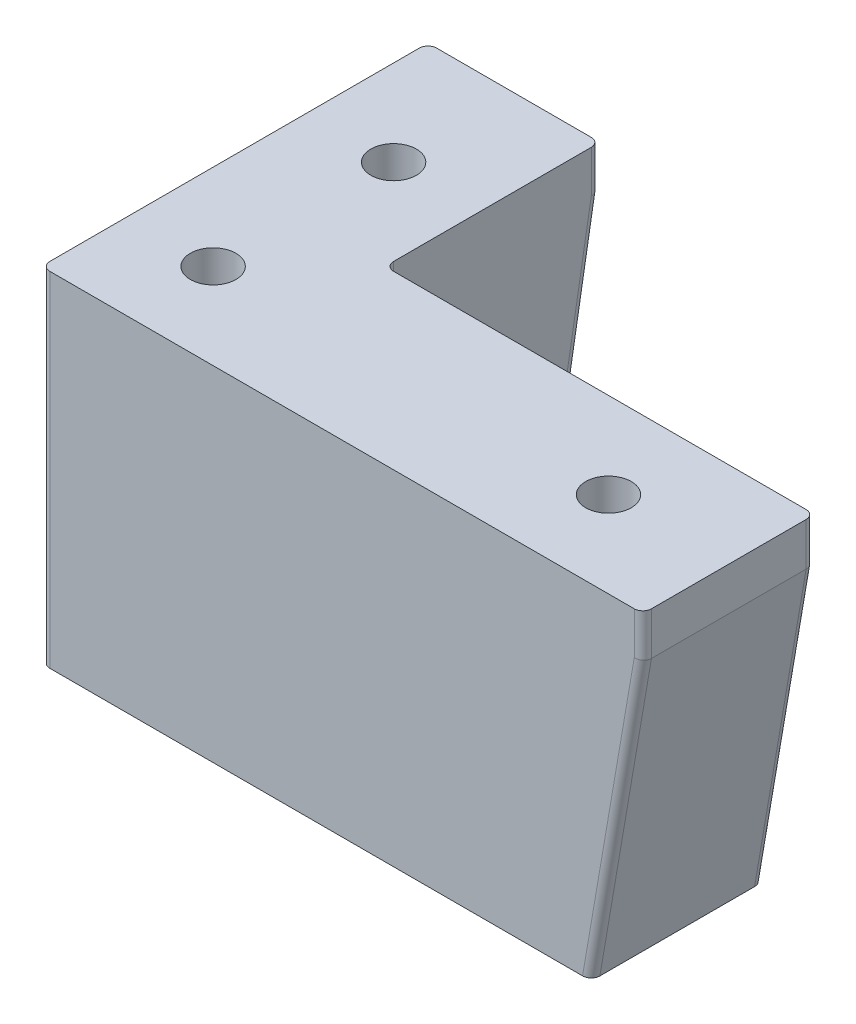
ISO-10303-21;
HEADER;
FILE_DESCRIPTION(('STEP AP214'),'2;1');
FILE_NAME('part.step','',(''),(''),'','','');
FILE_SCHEMA(('AUTOMOTIVE_DESIGN { 1 0 10303 214 1 1 1 1 }'));
ENDSEC;
DATA;
#1=APPLICATION_CONTEXT('core data for automotive mechanical design processes');
#2=APPLICATION_PROTOCOL_DEFINITION('international standard','automotive_design',2000,#1);
#3=PRODUCT_CONTEXT('',#1,'mechanical');
#4=PRODUCT('Part','Part','',(#3));
#5=PRODUCT_RELATED_PRODUCT_CATEGORY('part','',(#4));
#6=PRODUCT_DEFINITION_FORMATION('','',#4);
#7=PRODUCT_DEFINITION_CONTEXT('part definition',#1,'design');
#8=PRODUCT_DEFINITION('design','',#6,#7);
#9=PRODUCT_DEFINITION_SHAPE('','',#8);
#10=(LENGTH_UNIT() NAMED_UNIT(*) SI_UNIT(.MILLI.,.METRE.));
#11=(NAMED_UNIT(*) PLANE_ANGLE_UNIT() SI_UNIT($,.RADIAN.));
#12=(NAMED_UNIT(*) SI_UNIT($,.STERADIAN.) SOLID_ANGLE_UNIT());
#13=UNCERTAINTY_MEASURE_WITH_UNIT(LENGTH_MEASURE(1.E-05),#10,'distance_accuracy_value','');
#14=(GEOMETRIC_REPRESENTATION_CONTEXT(3) GLOBAL_UNCERTAINTY_ASSIGNED_CONTEXT((#13)) GLOBAL_UNIT_ASSIGNED_CONTEXT((#10,
#11,#12)) REPRESENTATION_CONTEXT('',''));
#15=CARTESIAN_POINT('',(0.,0.,0.));
#16=DIRECTION('',(0.,0.,1.));
#17=DIRECTION('',(1.,0.,0.));
#18=AXIS2_PLACEMENT_3D('',#15,#16,#17);
#19=CARTESIAN_POINT('',(56.,-5.,-10.));
#20=DIRECTION('',(0.,-1.,0.));
#21=DIRECTION('',(0.,0.,-1.));
#22=AXIS2_PLACEMENT_3D('',#19,#20,#21);
#23=PLANE('',#22);
#24=CARTESIAN_POINT('',(56.,-5.,-10.));
#25=DIRECTION('',(0.,-1.,0.));
#26=DIRECTION('',(0.,0.,-1.));
#27=AXIS2_PLACEMENT_3D('',#24,#25,#26);
#28=CIRCLE('',#27,5.);
#29=CARTESIAN_POINT('',(56.,-5.,-15.));
#30=VERTEX_POINT('',#29);
#31=EDGE_CURVE('E213',#30,#30,#28,.T.);
#32=ORIENTED_EDGE('',*,*,#31,.T.);
#33=EDGE_LOOP('',(#32));
#34=FACE_BOUND('',#33,.T.);
#35=CARTESIAN_POINT('',(56.,-5.,-10.));
#36=DIRECTION('',(0.,-1.,0.));
#37=DIRECTION('',(0.,0.,-1.));
#38=AXIS2_PLACEMENT_3D('',#35,#36,#37);
#39=CIRCLE('',#38,2.64999999999999);
#40=CARTESIAN_POINT('',(56.,-5.,-12.65));
#41=VERTEX_POINT('',#40);
#42=EDGE_CURVE('E254',#41,#41,#39,.F.);
#43=ORIENTED_EDGE('',*,*,#42,.T.);
#44=EDGE_LOOP('',(#43));
#45=FACE_BOUND('',#44,.T.);
#46=ADVANCED_FACE('F17',(#34,#45),#23,.T.);
#47=CARTESIAN_POINT('',(10.,-5.,-10.));
#48=DIRECTION('',(0.,-1.,0.));
#49=DIRECTION('',(0.,0.,-1.));
#50=AXIS2_PLACEMENT_3D('',#47,#48,#49);
#51=PLANE('',#50);
#52=CARTESIAN_POINT('',(10.,-5.,-10.));
#53=DIRECTION('',(0.,-1.,0.));
#54=DIRECTION('',(0.,0.,-1.));
#55=AXIS2_PLACEMENT_3D('',#52,#53,#54);
#56=CIRCLE('',#55,5.);
#57=CARTESIAN_POINT('',(10.,-5.,-15.));
#58=VERTEX_POINT('',#57);
#59=EDGE_CURVE('E247',#58,#58,#56,.T.);
#60=ORIENTED_EDGE('',*,*,#59,.T.);
#61=EDGE_LOOP('',(#60));
#62=FACE_BOUND('',#61,.T.);
#63=CARTESIAN_POINT('',(10.,-5.,-10.));
#64=DIRECTION('',(0.,-1.,0.));
#65=DIRECTION('',(0.,0.,-1.));
#66=AXIS2_PLACEMENT_3D('',#63,#64,#65);
#67=CIRCLE('',#66,2.64999999999999);
#68=CARTESIAN_POINT('',(10.,-5.,-12.65));
#69=VERTEX_POINT('',#68);
#70=EDGE_CURVE('E257',#69,#69,#67,.F.);
#71=ORIENTED_EDGE('',*,*,#70,.T.);
#72=EDGE_LOOP('',(#71));
#73=FACE_BOUND('',#72,.T.);
#74=ADVANCED_FACE('F574',(#62,#73),#51,.T.);
#75=CARTESIAN_POINT('',(10.,-5.,-31.));
#76=DIRECTION('',(0.,-1.,0.));
#77=DIRECTION('',(0.,0.,-1.));
#78=AXIS2_PLACEMENT_3D('',#75,#76,#77);
#79=PLANE('',#78);
#80=CARTESIAN_POINT('',(10.,-5.,-31.));
#81=DIRECTION('',(0.,-1.,0.));
#82=DIRECTION('',(0.,0.,-1.));
#83=AXIS2_PLACEMENT_3D('',#80,#81,#82);
#84=CIRCLE('',#83,5.);
#85=CARTESIAN_POINT('',(10.,-5.,-36.));
#86=VERTEX_POINT('',#85);
#87=EDGE_CURVE('E217',#86,#86,#84,.T.);
#88=ORIENTED_EDGE('',*,*,#87,.T.);
#89=EDGE_LOOP('',(#88));
#90=FACE_BOUND('',#89,.T.);
#91=CARTESIAN_POINT('',(10.,-5.,-31.));
#92=DIRECTION('',(0.,-1.,0.));
#93=DIRECTION('',(0.,0.,-1.));
#94=AXIS2_PLACEMENT_3D('',#91,#92,#93);
#95=CIRCLE('',#94,2.64999999999999);
#96=CARTESIAN_POINT('',(10.,-5.,-33.65));
#97=VERTEX_POINT('',#96);
#98=EDGE_CURVE('E146',#97,#97,#95,.F.);
#99=ORIENTED_EDGE('',*,*,#98,.T.);
#100=EDGE_LOOP('',(#99));
#101=FACE_BOUND('',#100,.T.);
#102=ADVANCED_FACE('F566',(#90,#101),#79,.T.);
#103=CARTESIAN_POINT('',(1.,-5.,-44.));
#104=DIRECTION('',(0.,1.,0.));
#105=DIRECTION('',(0.,0.,1.));
#106=AXIS2_PLACEMENT_3D('',#103,#104,#105);
#107=CYLINDRICAL_SURFACE('',#106,1.);
#108=CARTESIAN_POINT('',(1.,0.,-44.));
#109=DIRECTION('',(0.,1.,0.));
#110=DIRECTION('',(0.,0.,1.));
#111=AXIS2_PLACEMENT_3D('',#108,#109,#110);
#112=CIRCLE('',#111,1.);
#113=CARTESIAN_POINT('',(0.,0.,-44.));
#114=VERTEX_POINT('',#113);
#115=CARTESIAN_POINT('',(1.,0.,-45.));
#116=VERTEX_POINT('',#115);
#117=EDGE_CURVE('E20',#114,#116,#112,.F.);
#118=ORIENTED_EDGE('',*,*,#117,.T.);
#119=DIRECTION('',(0.,1.,0.));
#120=VECTOR('',#119,1.);
#121=CARTESIAN_POINT('',(1.,-5.,-45.));
#122=LINE('',#121,#120);
#123=CARTESIAN_POINT('',(1.,-5.00000000000007,-45.));
#124=VERTEX_POINT('',#123);
#125=EDGE_CURVE('E131',#124,#116,#122,.T.);
#126=ORIENTED_EDGE('',*,*,#125,.F.);
#127=CARTESIAN_POINT('',(1.,-4.91490636514523,-44.));
#128=DIRECTION('',(0.,-0.996399080392306,0.0847872195166622));
#129=DIRECTION('',(0.,0.0847872195166613,0.996399080392306));
#130=AXIS2_PLACEMENT_3D('',#127,#128,#129);
#131=ELLIPSE('',#130,1.00361393309022,1.);
#132=CARTESIAN_POINT('',(0.,-4.91490636514521,-44.));
#133=VERTEX_POINT('',#132);
#134=EDGE_CURVE('E276',#133,#124,#131,.T.);
#135=ORIENTED_EDGE('',*,*,#134,.F.);
#136=DIRECTION('',(0.,1.,0.));
#137=VECTOR('',#136,1.);
#138=CARTESIAN_POINT('',(0.,-5.,-44.));
#139=LINE('',#138,#137);
#140=EDGE_CURVE('E134',#114,#133,#139,.F.);
#141=ORIENTED_EDGE('',*,*,#140,.F.);
#142=EDGE_LOOP('',(#118,#126,#135,#141));
#143=FACE_BOUND('',#142,.T.);
#144=ADVANCED_FACE('F130',(#143),#107,.T.);
#145=CARTESIAN_POINT('',(1.,-4.83103618488916,-44.0143777451868));
#146=DIRECTION('',(0.,-0.985622254813267,0.168963815110846));
#147=DIRECTION('',(0.,-0.168963815110846,-0.985622254813267));
#148=AXIS2_PLACEMENT_3D('',#145,#146,#147);
#149=CYLINDRICAL_SURFACE('',#148,1.);
#150=ORIENTED_EDGE('',*,*,#134,.T.);
#151=DIRECTION('',(0.,0.985622254813267,-0.168963815110846));
#152=VECTOR('',#151,1.);
#153=CARTESIAN_POINT('',(1.,-7.63679619349722,-44.5479777954005));
#154=LINE('',#153,#152);
#155=CARTESIAN_POINT('',(1.,-40.,-39.));
#156=VERTEX_POINT('',#155);
#157=EDGE_CURVE('E189',#156,#124,#154,.T.);
#158=ORIENTED_EDGE('',*,*,#157,.F.);
#159=CARTESIAN_POINT('',(1.,-40.,-37.9854125197392));
#160=DIRECTION('',(0.,-1.,0.));
#161=DIRECTION('',(0.,0.,1.));
#162=AXIS2_PLACEMENT_3D('',#159,#160,#161);
#163=ELLIPSE('',#162,1.01458748026084,1.);
#164=CARTESIAN_POINT('',(0.,-40.,-37.9854125197392));
#165=VERTEX_POINT('',#164);
#166=EDGE_CURVE('E136',#156,#165,#163,.F.);
#167=ORIENTED_EDGE('',*,*,#166,.T.);
#168=DIRECTION('',(0.,-0.985622254813267,0.168963815110846));
#169=VECTOR('',#168,1.);
#170=CARTESIAN_POINT('',(0.,-4.9149063651452,-44.));
#171=LINE('',#170,#169);
#172=EDGE_CURVE('E195',#133,#165,#171,.T.);
#173=ORIENTED_EDGE('',*,*,#172,.F.);
#174=EDGE_LOOP('',(#150,#158,#167,#173));
#175=FACE_BOUND('',#174,.T.);
#176=ADVANCED_FACE('F280',(#175),#149,.T.);
#177=CARTESIAN_POINT('',(19.,-7.46783237838638,-43.5623555405872));
#178=DIRECTION('',(0.,-0.985622254813267,0.168963815110846));
#179=DIRECTION('',(0.,-0.168963815110846,-0.985622254813267));
#180=AXIS2_PLACEMENT_3D('',#177,#178,#179);
#181=CYLINDRICAL_SURFACE('',#180,1.);
#182=CARTESIAN_POINT('',(19.,-4.91490636514519,-44.));
#183=DIRECTION('',(0.,0.996399080392306,-0.0847872195166622));
#184=DIRECTION('',(0.,0.0847872195166613,0.996399080392306));
#185=AXIS2_PLACEMENT_3D('',#182,#183,#184);
#186=ELLIPSE('',#185,1.00361393309022,1.);
#187=CARTESIAN_POINT('',(20.,-4.91490636514526,-44.));
#188=VERTEX_POINT('',#187);
#189=CARTESIAN_POINT('',(19.,-5.00000000000005,-45.));
#190=VERTEX_POINT('',#189);
#191=EDGE_CURVE('E272',#188,#190,#186,.T.);
#192=ORIENTED_EDGE('',*,*,#191,.F.);
#193=DIRECTION('',(0.,0.985622254813267,-0.168963815110846));
#194=VECTOR('',#193,1.);
#195=CARTESIAN_POINT('',(20.,-40.,-37.9854125197392));
#196=LINE('',#195,#194);
#197=CARTESIAN_POINT('',(20.,-40.,-37.9854125197392));
#198=VERTEX_POINT('',#197);
#199=EDGE_CURVE('E182',#198,#188,#196,.T.);
#200=ORIENTED_EDGE('',*,*,#199,.F.);
#201=CARTESIAN_POINT('',(19.,-40.,-37.9854125197392));
#202=DIRECTION('',(0.,-1.,0.));
#203=DIRECTION('',(0.,0.,1.));
#204=AXIS2_PLACEMENT_3D('',#201,#202,#203);
#205=ELLIPSE('',#204,1.01458748026084,1.);
#206=CARTESIAN_POINT('',(19.,-40.,-39.));
#207=VERTEX_POINT('',#206);
#208=EDGE_CURVE('E274',#198,#207,#205,.F.);
#209=ORIENTED_EDGE('',*,*,#208,.T.);
#210=DIRECTION('',(0.,0.985622254813267,-0.168963815110846));
#211=VECTOR('',#210,1.);
#212=CARTESIAN_POINT('',(19.,-7.63679619349722,-44.5479777954005));
#213=LINE('',#212,#211);
#214=EDGE_CURVE('E192',#190,#207,#213,.F.);
#215=ORIENTED_EDGE('',*,*,#214,.F.);
#216=EDGE_LOOP('',(#192,#200,#209,#215));
#217=FACE_BOUND('',#216,.T.);
#218=ADVANCED_FACE('F340',(#217),#181,.T.);
#219=CARTESIAN_POINT('',(19.,-5.,-44.));
#220=DIRECTION('',(0.,1.,0.));
#221=DIRECTION('',(0.,0.,1.));
#222=AXIS2_PLACEMENT_3D('',#219,#220,#221);
#223=CYLINDRICAL_SURFACE('',#222,1.);
#224=CARTESIAN_POINT('',(19.,0.,-44.));
#225=DIRECTION('',(0.,1.,0.));
#226=DIRECTION('',(0.,0.,1.));
#227=AXIS2_PLACEMENT_3D('',#224,#225,#226);
#228=CIRCLE('',#227,1.);
#229=CARTESIAN_POINT('',(19.,0.,-45.));
#230=VERTEX_POINT('',#229);
#231=CARTESIAN_POINT('',(20.,0.,-44.));
#232=VERTEX_POINT('',#231);
#233=EDGE_CURVE('E151',#230,#232,#228,.F.);
#234=ORIENTED_EDGE('',*,*,#233,.T.);
#235=DIRECTION('',(0.,1.,0.));
#236=VECTOR('',#235,1.);
#237=CARTESIAN_POINT('',(20.,-5.,-44.));
#238=LINE('',#237,#236);
#239=EDGE_CURVE('E185',#188,#232,#238,.T.);
#240=ORIENTED_EDGE('',*,*,#239,.F.);
#241=ORIENTED_EDGE('',*,*,#191,.T.);
#242=DIRECTION('',(0.,1.,0.));
#243=VECTOR('',#242,1.);
#244=CARTESIAN_POINT('',(19.,-5.,-45.));
#245=LINE('',#244,#243);
#246=EDGE_CURVE('E145',#230,#190,#245,.F.);
#247=ORIENTED_EDGE('',*,*,#246,.F.);
#248=EDGE_LOOP('',(#234,#240,#241,#247));
#249=FACE_BOUND('',#248,.T.);
#250=ADVANCED_FACE('F337',(#249),#223,.T.);
#251=CARTESIAN_POINT('',(69.,-5.,-19.));
#252=DIRECTION('',(0.,1.,0.));
#253=DIRECTION('',(0.,0.,1.));
#254=AXIS2_PLACEMENT_3D('',#251,#252,#253);
#255=CYLINDRICAL_SURFACE('',#254,1.);
#256=CARTESIAN_POINT('',(69.,0.,-19.));
#257=DIRECTION('',(0.,1.,0.));
#258=DIRECTION('',(0.,0.,1.));
#259=AXIS2_PLACEMENT_3D('',#256,#257,#258);
#260=CIRCLE('',#259,1.);
#261=CARTESIAN_POINT('',(69.,0.,-20.));
#262=VERTEX_POINT('',#261);
#263=CARTESIAN_POINT('',(70.,0.,-19.));
#264=VERTEX_POINT('',#263);
#265=EDGE_CURVE('E269',#262,#264,#260,.F.);
#266=ORIENTED_EDGE('',*,*,#265,.T.);
#267=DIRECTION('',(0.,1.,0.));
#268=VECTOR('',#267,1.);
#269=CARTESIAN_POINT('',(70.,-5.,-19.));
#270=LINE('',#269,#268);
#271=CARTESIAN_POINT('',(70.,-5.00000000000011,-19.));
#272=VERTEX_POINT('',#271);
#273=EDGE_CURVE('E210',#272,#264,#270,.T.);
#274=ORIENTED_EDGE('',*,*,#273,.F.);
#275=CARTESIAN_POINT('',(69.,-4.91490636514523,-19.));
#276=DIRECTION('',(-0.0847872195166623,-0.996399080392306,0.));
#277=DIRECTION('',(-0.996399080392306,0.0847872195166619,0.));
#278=AXIS2_PLACEMENT_3D('',#275,#276,#277);
#279=ELLIPSE('',#278,1.00361393309022,1.);
#280=CARTESIAN_POINT('',(69.,-4.91490636514523,-20.));
#281=VERTEX_POINT('',#280);
#282=EDGE_CURVE('E264',#281,#272,#279,.T.);
#283=ORIENTED_EDGE('',*,*,#282,.F.);
#284=DIRECTION('',(0.,1.,0.));
#285=VECTOR('',#284,1.);
#286=CARTESIAN_POINT('',(69.,-5.,-20.));
#287=LINE('',#286,#285);
#288=EDGE_CURVE('E181',#262,#281,#287,.F.);
#289=ORIENTED_EDGE('',*,*,#288,.F.);
#290=EDGE_LOOP('',(#266,#274,#283,#289));
#291=FACE_BOUND('',#290,.T.);
#292=ADVANCED_FACE('F319',(#291),#255,.T.);
#293=CARTESIAN_POINT('',(69.0143777451868,-4.83103618488916,-19.));
#294=DIRECTION('',(-0.168963815110846,-0.985622254813267,0.));
#295=DIRECTION('',(0.985622254813267,-0.168963815110846,0.));
#296=AXIS2_PLACEMENT_3D('',#293,#294,#295);
#297=CYLINDRICAL_SURFACE('',#296,1.00000000000001);
#298=ORIENTED_EDGE('',*,*,#282,.T.);
#299=DIRECTION('',(0.168963815110846,0.985622254813267,0.));
#300=VECTOR('',#299,1.);
#301=CARTESIAN_POINT('',(68.8342585249802,-11.8001586042823,-19.));
#302=LINE('',#301,#300);
#303=CARTESIAN_POINT('',(64.,-40.,-19.));
#304=VERTEX_POINT('',#303);
#305=EDGE_CURVE('E202',#304,#272,#302,.T.);
#306=ORIENTED_EDGE('',*,*,#305,.F.);
#307=CARTESIAN_POINT('',(62.9854125197392,-40.,-19.));
#308=DIRECTION('',(0.,-1.,0.));
#309=DIRECTION('',(-1.,0.,0.));
#310=AXIS2_PLACEMENT_3D('',#307,#308,#309);
#311=ELLIPSE('',#310,1.01458748026085,1.00000000000001);
#312=CARTESIAN_POINT('',(62.9854125197392,-40.,-20.));
#313=VERTEX_POINT('',#312);
#314=EDGE_CURVE('E267',#304,#313,#311,.F.);
#315=ORIENTED_EDGE('',*,*,#314,.T.);
#316=DIRECTION('',(-0.168963815110846,-0.985622254813267,0.));
#317=VECTOR('',#316,1.);
#318=CARTESIAN_POINT('',(69.,-4.91490636514522,-20.));
#319=LINE('',#318,#317);
#320=EDGE_CURVE('E178',#281,#313,#319,.T.);
#321=ORIENTED_EDGE('',*,*,#320,.F.);
#322=EDGE_LOOP('',(#298,#306,#315,#321));
#323=FACE_BOUND('',#322,.T.);
#324=ADVANCED_FACE('F346',(#323),#297,.T.);
#325=CARTESIAN_POINT('',(21.,-5.,-21.));
#326=DIRECTION('',(0.,-1.,0.));
#327=DIRECTION('',(0.,0.,-1.));
#328=AXIS2_PLACEMENT_3D('',#325,#326,#327);
#329=CYLINDRICAL_SURFACE('',#328,1.);
#330=DIRECTION('',(0.,1.,0.));
#331=VECTOR('',#330,1.);
#332=CARTESIAN_POINT('',(20.,-5.,-21.));
#333=LINE('',#332,#331);
#334=CARTESIAN_POINT('',(20.,0.,-21.));
#335=VERTEX_POINT('',#334);
#336=CARTESIAN_POINT('',(20.,-40.,-21.));
#337=VERTEX_POINT('',#336);
#338=EDGE_CURVE('E186',#335,#337,#333,.F.);
#339=ORIENTED_EDGE('',*,*,#338,.F.);
#340=CARTESIAN_POINT('',(21.,0.,-21.));
#341=DIRECTION('',(0.,-1.,0.));
#342=DIRECTION('',(0.,0.,-1.));
#343=AXIS2_PLACEMENT_3D('',#340,#341,#342);
#344=CIRCLE('',#343,1.);
#345=CARTESIAN_POINT('',(21.,0.,-20.));
#346=VERTEX_POINT('',#345);
#347=EDGE_CURVE('E262',#346,#335,#344,.T.);
#348=ORIENTED_EDGE('',*,*,#347,.F.);
#349=DIRECTION('',(0.,1.,0.));
#350=VECTOR('',#349,1.);
#351=CARTESIAN_POINT('',(21.,-5.,-20.));
#352=LINE('',#351,#350);
#353=CARTESIAN_POINT('',(21.,-40.,-20.));
#354=VERTEX_POINT('',#353);
#355=EDGE_CURVE('E175',#354,#346,#352,.T.);
#356=ORIENTED_EDGE('',*,*,#355,.F.);
#357=CARTESIAN_POINT('',(21.,-40.,-21.));
#358=DIRECTION('',(0.,-1.,0.));
#359=DIRECTION('',(0.,0.,-1.));
#360=AXIS2_PLACEMENT_3D('',#357,#358,#359);
#361=CIRCLE('',#360,1.);
#362=EDGE_CURVE('E260',#337,#354,#361,.F.);
#363=ORIENTED_EDGE('',*,*,#362,.F.);
#364=EDGE_LOOP('',(#339,#348,#356,#363));
#365=FACE_BOUND('',#364,.T.);
#366=ADVANCED_FACE('F329',(#365),#329,.F.);
#367=CARTESIAN_POINT('',(10.,-5.,-10.));
#368=DIRECTION('',(0.,-1.,0.));
#369=DIRECTION('',(0.,0.,-1.));
#370=AXIS2_PLACEMENT_3D('',#367,#368,#369);
#371=CYLINDRICAL_SURFACE('',#370,2.64999999999999);
#372=CARTESIAN_POINT('',(10.,0.,-10.));
#373=DIRECTION('',(0.,-1.,0.));
#374=DIRECTION('',(0.,0.,-1.));
#375=AXIS2_PLACEMENT_3D('',#372,#373,#374);
#376=CIRCLE('',#375,2.64999999999999);
#377=CARTESIAN_POINT('',(10.,0.,-12.65));
#378=VERTEX_POINT('',#377);
#379=EDGE_CURVE('E170',#378,#378,#376,.T.);
#380=ORIENTED_EDGE('',*,*,#379,.F.);
#381=EDGE_LOOP('',(#380));
#382=FACE_BOUND('',#381,.T.);
#383=ORIENTED_EDGE('',*,*,#70,.F.);
#384=EDGE_LOOP('',(#383));
#385=FACE_BOUND('',#384,.T.);
#386=ADVANCED_FACE('F507',(#382,#385),#371,.F.);
#387=CARTESIAN_POINT('',(56.,-5.,-10.));
#388=DIRECTION('',(0.,-1.,0.));
#389=DIRECTION('',(0.,0.,-1.));
#390=AXIS2_PLACEMENT_3D('',#387,#388,#389);
#391=CYLINDRICAL_SURFACE('',#390,2.64999999999999);
#392=CARTESIAN_POINT('',(56.,0.,-10.));
#393=DIRECTION('',(0.,-1.,0.));
#394=DIRECTION('',(0.,0.,-1.));
#395=AXIS2_PLACEMENT_3D('',#392,#393,#394);
#396=CIRCLE('',#395,2.64999999999999);
#397=CARTESIAN_POINT('',(56.,0.,-12.65));
#398=VERTEX_POINT('',#397);
#399=EDGE_CURVE('E159',#398,#398,#396,.T.);
#400=ORIENTED_EDGE('',*,*,#399,.F.);
#401=EDGE_LOOP('',(#400));
#402=FACE_BOUND('',#401,.T.);
#403=ORIENTED_EDGE('',*,*,#42,.F.);
#404=EDGE_LOOP('',(#403));
#405=FACE_BOUND('',#404,.T.);
#406=ADVANCED_FACE('F498',(#402,#405),#391,.F.);
#407=CARTESIAN_POINT('',(10.,-5.,-31.));
#408=DIRECTION('',(0.,-1.,0.));
#409=DIRECTION('',(0.,0.,-1.));
#410=AXIS2_PLACEMENT_3D('',#407,#408,#409);
#411=CYLINDRICAL_SURFACE('',#410,2.64999999999999);
#412=CARTESIAN_POINT('',(10.,0.,-31.));
#413=DIRECTION('',(0.,-1.,0.));
#414=DIRECTION('',(0.,0.,-1.));
#415=AXIS2_PLACEMENT_3D('',#412,#413,#414);
#416=CIRCLE('',#415,2.64999999999999);
#417=CARTESIAN_POINT('',(10.,0.,-33.65));
#418=VERTEX_POINT('',#417);
#419=EDGE_CURVE('E154',#418,#418,#416,.T.);
#420=ORIENTED_EDGE('',*,*,#419,.F.);
#421=EDGE_LOOP('',(#420));
#422=FACE_BOUND('',#421,.T.);
#423=ORIENTED_EDGE('',*,*,#98,.F.);
#424=EDGE_LOOP('',(#423));
#425=FACE_BOUND('',#424,.T.);
#426=ADVANCED_FACE('F490',(#422,#425),#411,.F.);
#427=CARTESIAN_POINT('',(20.,-5.,-45.));
#428=DIRECTION('',(0.,0.,-1.));
#429=DIRECTION('',(-1.,0.,0.));
#430=AXIS2_PLACEMENT_3D('',#427,#428,#429);
#431=PLANE('',#430);
#432=DIRECTION('',(1.,0.,0.));
#433=VECTOR('',#432,1.);
#434=CARTESIAN_POINT('',(0.,0.,-45.));
#435=LINE('',#434,#433);
#436=EDGE_CURVE('E141',#230,#116,#435,.F.);
#437=ORIENTED_EDGE('',*,*,#436,.F.);
#438=ORIENTED_EDGE('',*,*,#246,.T.);
#439=DIRECTION('',(1.,0.,0.));
#440=VECTOR('',#439,1.);
#441=CARTESIAN_POINT('',(0.,-5.,-45.));
#442=LINE('',#441,#440);
#443=EDGE_CURVE('E143',#124,#190,#442,.T.);
#444=ORIENTED_EDGE('',*,*,#443,.F.);
#445=ORIENTED_EDGE('',*,*,#125,.T.);
#446=EDGE_LOOP('',(#437,#438,#444,#445));
#447=FACE_BOUND('',#446,.T.);
#448=ADVANCED_FACE('F139',(#447),#431,.T.);
#449=CARTESIAN_POINT('',(70.,-5.,0.));
#450=DIRECTION('',(1.,0.,0.));
#451=DIRECTION('',(0.,0.,-1.));
#452=AXIS2_PLACEMENT_3D('',#449,#450,#451);
#453=PLANE('',#452);
#454=DIRECTION('',(0.,0.,1.));
#455=VECTOR('',#454,1.);
#456=CARTESIAN_POINT('',(70.,0.,0.));
#457=LINE('',#456,#455);
#458=CARTESIAN_POINT('',(70.,0.,-1.));
#459=VERTEX_POINT('',#458);
#460=EDGE_CURVE('E237',#459,#264,#457,.F.);
#461=ORIENTED_EDGE('',*,*,#460,.F.);
#462=DIRECTION('',(0.,1.,0.));
#463=VECTOR('',#462,1.);
#464=CARTESIAN_POINT('',(70.,-5.,-1.));
#465=LINE('',#464,#463);
#466=CARTESIAN_POINT('',(70.,-5.00000000000009,-1.));
#467=VERTEX_POINT('',#466);
#468=EDGE_CURVE('E168',#467,#459,#465,.T.);
#469=ORIENTED_EDGE('',*,*,#468,.F.);
#470=DIRECTION('',(0.,0.,1.));
#471=VECTOR('',#470,1.);
#472=CARTESIAN_POINT('',(70.,-5.00000000000001,0.));
#473=LINE('',#472,#471);
#474=EDGE_CURVE('E205',#272,#467,#473,.T.);
#475=ORIENTED_EDGE('',*,*,#474,.F.);
#476=ORIENTED_EDGE('',*,*,#273,.T.);
#477=EDGE_LOOP('',(#461,#469,#475,#476));
#478=FACE_BOUND('',#477,.T.);
#479=ADVANCED_FACE('F316',(#478),#453,.T.);
#480=CARTESIAN_POINT('',(56.,-5.,-10.));
#481=DIRECTION('',(0.,-1.,0.));
#482=DIRECTION('',(0.,0.,-1.));
#483=AXIS2_PLACEMENT_3D('',#480,#481,#482);
#484=CYLINDRICAL_SURFACE('',#483,5.);
#485=CARTESIAN_POINT('',(56.,-40.,-10.));
#486=DIRECTION('',(0.,-1.,0.));
#487=DIRECTION('',(0.,0.,-1.));
#488=AXIS2_PLACEMENT_3D('',#485,#486,#487);
#489=CIRCLE('',#488,5.);
#490=CARTESIAN_POINT('',(56.,-40.,-15.));
#491=VERTEX_POINT('',#490);
#492=EDGE_CURVE('E200',#491,#491,#489,.F.);
#493=ORIENTED_EDGE('',*,*,#492,.F.);
#494=EDGE_LOOP('',(#493));
#495=FACE_BOUND('',#494,.T.);
#496=ORIENTED_EDGE('',*,*,#31,.F.);
#497=EDGE_LOOP('',(#496));
#498=FACE_BOUND('',#497,.T.);
#499=ADVANCED_FACE('F466',(#495,#498),#484,.F.);
#500=CARTESIAN_POINT('',(10.,-5.,-10.));
#501=DIRECTION('',(0.,-1.,0.));
#502=DIRECTION('',(0.,0.,-1.));
#503=AXIS2_PLACEMENT_3D('',#500,#501,#502);
#504=CYLINDRICAL_SURFACE('',#503,5.);
#505=CARTESIAN_POINT('',(10.,-40.,-10.));
#506=DIRECTION('',(0.,-1.,0.));
#507=DIRECTION('',(0.,0.,-1.));
#508=AXIS2_PLACEMENT_3D('',#505,#506,#507);
#509=CIRCLE('',#508,5.);
#510=CARTESIAN_POINT('',(10.,-40.,-15.));
#511=VERTEX_POINT('',#510);
#512=EDGE_CURVE('E228',#511,#511,#509,.F.);
#513=ORIENTED_EDGE('',*,*,#512,.F.);
#514=EDGE_LOOP('',(#513));
#515=FACE_BOUND('',#514,.T.);
#516=ORIENTED_EDGE('',*,*,#59,.F.);
#517=EDGE_LOOP('',(#516));
#518=FACE_BOUND('',#517,.T.);
#519=ADVANCED_FACE('F457',(#515,#518),#504,.F.);
#520=CARTESIAN_POINT('',(10.,-5.,-31.));
#521=DIRECTION('',(0.,-1.,0.));
#522=DIRECTION('',(0.,0.,-1.));
#523=AXIS2_PLACEMENT_3D('',#520,#521,#522);
#524=CYLINDRICAL_SURFACE('',#523,5.);
#525=CARTESIAN_POINT('',(10.,-40.,-31.));
#526=DIRECTION('',(0.,-1.,0.));
#527=DIRECTION('',(0.,0.,-1.));
#528=AXIS2_PLACEMENT_3D('',#525,#526,#527);
#529=CIRCLE('',#528,5.);
#530=CARTESIAN_POINT('',(10.,-40.,-36.));
#531=VERTEX_POINT('',#530);
#532=EDGE_CURVE('E225',#531,#531,#529,.F.);
#533=ORIENTED_EDGE('',*,*,#532,.F.);
#534=EDGE_LOOP('',(#533));
#535=FACE_BOUND('',#534,.T.);
#536=ORIENTED_EDGE('',*,*,#87,.F.);
#537=EDGE_LOOP('',(#536));
#538=FACE_BOUND('',#537,.T.);
#539=ADVANCED_FACE('F449',(#535,#538),#524,.F.);
#540=CARTESIAN_POINT('',(68.8342585249802,-11.8001586042823,0.));
#541=DIRECTION('',(0.985622254813267,-0.168963815110846,0.));
#542=DIRECTION('',(0.168963815110846,0.985622254813267,0.));
#543=AXIS2_PLACEMENT_3D('',#540,#541,#542);
#544=PLANE('',#543);
#545=DIRECTION('',(0.,0.,-1.));
#546=VECTOR('',#545,1.);
#547=CARTESIAN_POINT('',(64.,-40.,0.));
#548=LINE('',#547,#546);
#549=CARTESIAN_POINT('',(64.,-40.,-1.));
#550=VERTEX_POINT('',#549);
#551=EDGE_CURVE('E224',#304,#550,#548,.F.);
#552=ORIENTED_EDGE('',*,*,#551,.F.);
#553=ORIENTED_EDGE('',*,*,#305,.T.);
#554=ORIENTED_EDGE('',*,*,#474,.T.);
#555=DIRECTION('',(-0.168963815110846,-0.985622254813267,0.));
#556=VECTOR('',#555,1.);
#557=CARTESIAN_POINT('',(68.8342585249802,-11.8001586042823,-1.));
#558=LINE('',#557,#556);
#559=EDGE_CURVE('E172',#550,#467,#558,.F.);
#560=ORIENTED_EDGE('',*,*,#559,.F.);
#561=EDGE_LOOP('',(#552,#553,#554,#560));
#562=FACE_BOUND('',#561,.T.);
#563=ADVANCED_FACE('F349',(#562),#544,.T.);
#564=CARTESIAN_POINT('',(0.,-5.,-45.));
#565=DIRECTION('',(-1.,0.,0.));
#566=DIRECTION('',(0.,0.,1.));
#567=AXIS2_PLACEMENT_3D('',#564,#565,#566);
#568=PLANE('',#567);
#569=DIRECTION('',(0.,0.,-1.));
#570=VECTOR('',#569,1.);
#571=CARTESIAN_POINT('',(0.,-40.,0.));
#572=LINE('',#571,#570);
#573=CARTESIAN_POINT('',(0.,-40.,-1.00000000000001));
#574=VERTEX_POINT('',#573);
#575=EDGE_CURVE('E220',#574,#165,#572,.T.);
#576=ORIENTED_EDGE('',*,*,#575,.F.);
#577=DIRECTION('',(0.,1.,0.));
#578=VECTOR('',#577,1.);
#579=CARTESIAN_POINT('',(0.,-5.,-1.00000000000002));
#580=LINE('',#579,#578);
#581=CARTESIAN_POINT('',(0.,0.,-1.00000000000001));
#582=VERTEX_POINT('',#581);
#583=EDGE_CURVE('E198',#582,#574,#580,.F.);
#584=ORIENTED_EDGE('',*,*,#583,.F.);
#585=DIRECTION('',(0.,0.,1.));
#586=VECTOR('',#585,1.);
#587=CARTESIAN_POINT('',(0.,0.,0.));
#588=LINE('',#587,#586);
#589=EDGE_CURVE('E153',#114,#582,#588,.T.);
#590=ORIENTED_EDGE('',*,*,#589,.F.);
#591=ORIENTED_EDGE('',*,*,#140,.T.);
#592=ORIENTED_EDGE('',*,*,#172,.T.);
#593=EDGE_LOOP('',(#576,#584,#590,#591,#592));
#594=FACE_BOUND('',#593,.T.);
#595=ADVANCED_FACE('F287',(#594),#568,.T.);
#596=CARTESIAN_POINT('',(0.,-7.63679619349722,-44.5479777954005));
#597=DIRECTION('',(0.,-0.168963815110846,-0.985622254813267));
#598=DIRECTION('',(0.,0.985622254813267,-0.168963815110846));
#599=AXIS2_PLACEMENT_3D('',#596,#597,#598);
#600=PLANE('',#599);
#601=DIRECTION('',(1.,0.,0.));
#602=VECTOR('',#601,1.);
#603=CARTESIAN_POINT('',(0.,-40.,-39.));
#604=LINE('',#603,#602);
#605=EDGE_CURVE('E292',#156,#207,#604,.T.);
#606=ORIENTED_EDGE('',*,*,#605,.F.);
#607=ORIENTED_EDGE('',*,*,#157,.T.);
#608=ORIENTED_EDGE('',*,*,#443,.T.);
#609=ORIENTED_EDGE('',*,*,#214,.T.);
#610=EDGE_LOOP('',(#606,#607,#608,#609));
#611=FACE_BOUND('',#610,.T.);
#612=ADVANCED_FACE('F342',(#611),#600,.T.);
#613=CARTESIAN_POINT('',(20.,-5.,-20.));
#614=DIRECTION('',(1.,0.,0.));
#615=DIRECTION('',(0.,0.,-1.));
#616=AXIS2_PLACEMENT_3D('',#613,#614,#615);
#617=PLANE('',#616);
#618=ORIENTED_EDGE('',*,*,#199,.T.);
#619=ORIENTED_EDGE('',*,*,#239,.T.);
#620=DIRECTION('',(0.,0.,1.));
#621=VECTOR('',#620,1.);
#622=CARTESIAN_POINT('',(20.,0.,0.));
#623=LINE('',#622,#621);
#624=EDGE_CURVE('E235',#335,#232,#623,.F.);
#625=ORIENTED_EDGE('',*,*,#624,.F.);
#626=ORIENTED_EDGE('',*,*,#338,.T.);
#627=DIRECTION('',(0.,0.,-1.));
#628=VECTOR('',#627,1.);
#629=CARTESIAN_POINT('',(20.,-40.,0.));
#630=LINE('',#629,#628);
#631=EDGE_CURVE('E294',#198,#337,#630,.F.);
#632=ORIENTED_EDGE('',*,*,#631,.F.);
#633=EDGE_LOOP('',(#618,#619,#625,#626,#632));
#634=FACE_BOUND('',#633,.T.);
#635=ADVANCED_FACE('F333',(#634),#617,.T.);
#636=CARTESIAN_POINT('',(70.,-5.,-20.));
#637=DIRECTION('',(0.,0.,-1.));
#638=DIRECTION('',(-1.,0.,0.));
#639=AXIS2_PLACEMENT_3D('',#636,#637,#638);
#640=PLANE('',#639);
#641=DIRECTION('',(1.,0.,0.));
#642=VECTOR('',#641,1.);
#643=CARTESIAN_POINT('',(0.,-40.,-20.));
#644=LINE('',#643,#642);
#645=EDGE_CURVE('E304',#354,#313,#644,.T.);
#646=ORIENTED_EDGE('',*,*,#645,.F.);
#647=ORIENTED_EDGE('',*,*,#355,.T.);
#648=DIRECTION('',(1.,0.,0.));
#649=VECTOR('',#648,1.);
#650=CARTESIAN_POINT('',(0.,0.,-20.));
#651=LINE('',#650,#649);
#652=EDGE_CURVE('E308',#262,#346,#651,.F.);
#653=ORIENTED_EDGE('',*,*,#652,.F.);
#654=ORIENTED_EDGE('',*,*,#288,.T.);
#655=ORIENTED_EDGE('',*,*,#320,.T.);
#656=EDGE_LOOP('',(#646,#647,#653,#654,#655));
#657=FACE_BOUND('',#656,.T.);
#658=ADVANCED_FACE('F324',(#657),#640,.T.);
#659=CARTESIAN_POINT('',(67.8486362701669,-11.6311947891715,-1.));
#660=DIRECTION('',(-0.168963815110846,-0.985622254813267,0.));
#661=DIRECTION('',(0.985622254813267,-0.168963815110846,0.));
#662=AXIS2_PLACEMENT_3D('',#659,#660,#661);
#663=CYLINDRICAL_SURFACE('',#662,1.00000000000001);
#664=CARTESIAN_POINT('',(69.,-4.91490636514522,-1.));
#665=DIRECTION('',(0.0847872195166623,0.996399080392306,0.));
#666=DIRECTION('',(-0.996399080392306,0.0847872195166619,0.));
#667=AXIS2_PLACEMENT_3D('',#664,#665,#666);
#668=ELLIPSE('',#667,1.00361393309022,1.);
#669=CARTESIAN_POINT('',(69.,-4.91490636514516,0.));
#670=VERTEX_POINT('',#669);
#671=EDGE_CURVE('E171',#670,#467,#668,.T.);
#672=ORIENTED_EDGE('',*,*,#671,.F.);
#673=DIRECTION('',(0.168963815110846,0.985622254813267,0.));
#674=VECTOR('',#673,1.);
#675=CARTESIAN_POINT('',(62.9854125197392,-40.,0.));
#676=LINE('',#675,#674);
#677=CARTESIAN_POINT('',(62.9854125197392,-40.,0.));
#678=VERTEX_POINT('',#677);
#679=EDGE_CURVE('E167',#678,#670,#676,.T.);
#680=ORIENTED_EDGE('',*,*,#679,.F.);
#681=CARTESIAN_POINT('',(62.9854125197392,-40.,-1.));
#682=DIRECTION('',(0.,-1.,0.));
#683=DIRECTION('',(-1.,0.,0.));
#684=AXIS2_PLACEMENT_3D('',#681,#682,#683);
#685=ELLIPSE('',#684,1.01458748026085,1.00000000000001);
#686=EDGE_CURVE('E221',#550,#678,#685,.T.);
#687=ORIENTED_EDGE('',*,*,#686,.F.);
#688=ORIENTED_EDGE('',*,*,#559,.T.);
#689=EDGE_LOOP('',(#672,#680,#687,#688));
#690=FACE_BOUND('',#689,.T.);
#691=ADVANCED_FACE('F358',(#690),#663,.T.);
#692=CARTESIAN_POINT('',(69.,-5.,-1.));
#693=DIRECTION('',(0.,1.,0.));
#694=DIRECTION('',(0.,0.,1.));
#695=AXIS2_PLACEMENT_3D('',#692,#693,#694);
#696=CYLINDRICAL_SURFACE('',#695,1.);
#697=CARTESIAN_POINT('',(69.,0.,-1.));
#698=DIRECTION('',(0.,1.,0.));
#699=DIRECTION('',(0.,0.,1.));
#700=AXIS2_PLACEMENT_3D('',#697,#698,#699);
#701=CIRCLE('',#700,1.);
#702=CARTESIAN_POINT('',(69.,0.,0.));
#703=VERTEX_POINT('',#702);
#704=EDGE_CURVE('E156',#703,#459,#701,.T.);
#705=ORIENTED_EDGE('',*,*,#704,.F.);
#706=DIRECTION('',(0.,1.,0.));
#707=VECTOR('',#706,1.);
#708=CARTESIAN_POINT('',(69.,-5.,0.));
#709=LINE('',#708,#707);
#710=EDGE_CURVE('E163',#670,#703,#709,.T.);
#711=ORIENTED_EDGE('',*,*,#710,.F.);
#712=ORIENTED_EDGE('',*,*,#671,.T.);
#713=ORIENTED_EDGE('',*,*,#468,.T.);
#714=EDGE_LOOP('',(#705,#711,#712,#713));
#715=FACE_BOUND('',#714,.T.);
#716=ADVANCED_FACE('F357',(#715),#696,.T.);
#717=CARTESIAN_POINT('',(0.,0.,0.));
#718=DIRECTION('',(0.,1.,0.));
#719=DIRECTION('',(0.,0.,1.));
#720=AXIS2_PLACEMENT_3D('',#717,#718,#719);
#721=PLANE('',#720);
#722=ORIENTED_EDGE('',*,*,#624,.T.);
#723=ORIENTED_EDGE('',*,*,#233,.F.);
#724=ORIENTED_EDGE('',*,*,#436,.T.);
#725=ORIENTED_EDGE('',*,*,#117,.F.);
#726=ORIENTED_EDGE('',*,*,#589,.T.);
#727=CARTESIAN_POINT('',(1.,0.,-1.));
#728=DIRECTION('',(0.,1.,0.));
#729=DIRECTION('',(0.,0.,1.));
#730=AXIS2_PLACEMENT_3D('',#727,#728,#729);
#731=CIRCLE('',#730,1.);
#732=CARTESIAN_POINT('',(1.,0.,0.));
#733=VERTEX_POINT('',#732);
#734=EDGE_CURVE('E201',#733,#582,#731,.F.);
#735=ORIENTED_EDGE('',*,*,#734,.F.);
#736=DIRECTION('',(1.,0.,0.));
#737=VECTOR('',#736,1.);
#738=CARTESIAN_POINT('',(0.,0.,0.));
#739=LINE('',#738,#737);
#740=EDGE_CURVE('E166',#703,#733,#739,.F.);
#741=ORIENTED_EDGE('',*,*,#740,.F.);
#742=ORIENTED_EDGE('',*,*,#704,.T.);
#743=ORIENTED_EDGE('',*,*,#460,.T.);
#744=ORIENTED_EDGE('',*,*,#265,.F.);
#745=ORIENTED_EDGE('',*,*,#652,.T.);
#746=ORIENTED_EDGE('',*,*,#347,.T.);
#747=EDGE_LOOP('',(#722,#723,#724,#725,#726,#735,#741,#742,#743,#744,#745,#746));
#748=FACE_BOUND('',#747,.T.);
#749=ORIENTED_EDGE('',*,*,#419,.T.);
#750=EDGE_LOOP('',(#749));
#751=FACE_BOUND('',#750,.T.);
#752=ORIENTED_EDGE('',*,*,#399,.T.);
#753=EDGE_LOOP('',(#752));
#754=FACE_BOUND('',#753,.T.);
#755=ORIENTED_EDGE('',*,*,#379,.T.);
#756=EDGE_LOOP('',(#755));
#757=FACE_BOUND('',#756,.T.);
#758=ADVANCED_FACE('F149',(#748,#751,#754,#757),#721,.T.);
#759=CARTESIAN_POINT('',(1.,-5.,-1.));
#760=DIRECTION('',(0.,1.,0.));
#761=DIRECTION('',(0.,0.,1.));
#762=AXIS2_PLACEMENT_3D('',#759,#760,#761);
#763=CYLINDRICAL_SURFACE('',#762,1.);
#764=ORIENTED_EDGE('',*,*,#734,.T.);
#765=ORIENTED_EDGE('',*,*,#583,.T.);
#766=CARTESIAN_POINT('',(1.,-40.,-1.));
#767=DIRECTION('',(0.,1.,0.));
#768=DIRECTION('',(0.,0.,1.));
#769=AXIS2_PLACEMENT_3D('',#766,#767,#768);
#770=CIRCLE('',#769,1.);
#771=CARTESIAN_POINT('',(1.,-40.,0.));
#772=VERTEX_POINT('',#771);
#773=EDGE_CURVE('E35',#772,#574,#770,.F.);
#774=ORIENTED_EDGE('',*,*,#773,.F.);
#775=DIRECTION('',(0.,1.,0.));
#776=VECTOR('',#775,1.);
#777=CARTESIAN_POINT('',(1.,-5.,0.));
#778=LINE('',#777,#776);
#779=EDGE_CURVE('E26',#733,#772,#778,.F.);
#780=ORIENTED_EDGE('',*,*,#779,.F.);
#781=EDGE_LOOP('',(#764,#765,#774,#780));
#782=FACE_BOUND('',#781,.T.);
#783=ADVANCED_FACE('F354',(#782),#763,.T.);
#784=CARTESIAN_POINT('',(0.,-40.,0.));
#785=DIRECTION('',(0.,-1.,0.));
#786=DIRECTION('',(0.,0.,-1.));
#787=AXIS2_PLACEMENT_3D('',#784,#785,#786);
#788=PLANE('',#787);
#789=ORIENTED_EDGE('',*,*,#645,.T.);
#790=ORIENTED_EDGE('',*,*,#314,.F.);
#791=ORIENTED_EDGE('',*,*,#551,.T.);
#792=ORIENTED_EDGE('',*,*,#686,.T.);
#793=DIRECTION('',(1.,0.,0.));
#794=VECTOR('',#793,1.);
#795=CARTESIAN_POINT('',(0.,-40.,0.));
#796=LINE('',#795,#794);
#797=EDGE_CURVE('E11',#772,#678,#796,.T.);
#798=ORIENTED_EDGE('',*,*,#797,.F.);
#799=ORIENTED_EDGE('',*,*,#773,.T.);
#800=ORIENTED_EDGE('',*,*,#575,.T.);
#801=ORIENTED_EDGE('',*,*,#166,.F.);
#802=ORIENTED_EDGE('',*,*,#605,.T.);
#803=ORIENTED_EDGE('',*,*,#208,.F.);
#804=ORIENTED_EDGE('',*,*,#631,.T.);
#805=ORIENTED_EDGE('',*,*,#362,.T.);
#806=EDGE_LOOP('',(#789,#790,#791,#792,#798,#799,#800,#801,#802,#803,#804,#805));
#807=FACE_BOUND('',#806,.T.);
#808=ORIENTED_EDGE('',*,*,#532,.T.);
#809=EDGE_LOOP('',(#808));
#810=FACE_BOUND('',#809,.T.);
#811=ORIENTED_EDGE('',*,*,#512,.T.);
#812=EDGE_LOOP('',(#811));
#813=FACE_BOUND('',#812,.T.);
#814=ORIENTED_EDGE('',*,*,#492,.T.);
#815=EDGE_LOOP('',(#814));
#816=FACE_BOUND('',#815,.T.);
#817=ADVANCED_FACE('F290',(#807,#810,#813,#816),#788,.T.);
#818=CARTESIAN_POINT('',(0.,-5.,0.));
#819=DIRECTION('',(0.,0.,1.));
#820=DIRECTION('',(1.,0.,0.));
#821=AXIS2_PLACEMENT_3D('',#818,#819,#820);
#822=PLANE('',#821);
#823=ORIENTED_EDGE('',*,*,#779,.T.);
#824=ORIENTED_EDGE('',*,*,#797,.T.);
#825=ORIENTED_EDGE('',*,*,#679,.T.);
#826=ORIENTED_EDGE('',*,*,#710,.T.);
#827=ORIENTED_EDGE('',*,*,#740,.T.);
#828=EDGE_LOOP('',(#823,#824,#825,#826,#827));
#829=FACE_BOUND('',#828,.T.);
#830=ADVANCED_FACE('F353',(#829),#822,.T.);
#831=CLOSED_SHELL('',(#46,#74,#102,#144,#176,#218,#250,#292,#324,#366,#386,#406,#426,#448,#479,
#499,#519,#539,#563,#595,#612,#635,#658,#691,#716,#758,#783,#817,#830));
#832=MANIFOLD_SOLID_BREP('B1',#831);
#833=ADVANCED_BREP_SHAPE_REPRESENTATION('',(#18,#832),#14);
#834=SHAPE_DEFINITION_REPRESENTATION(#9,#833);
ENDSEC;
END-ISO-10303-21;
